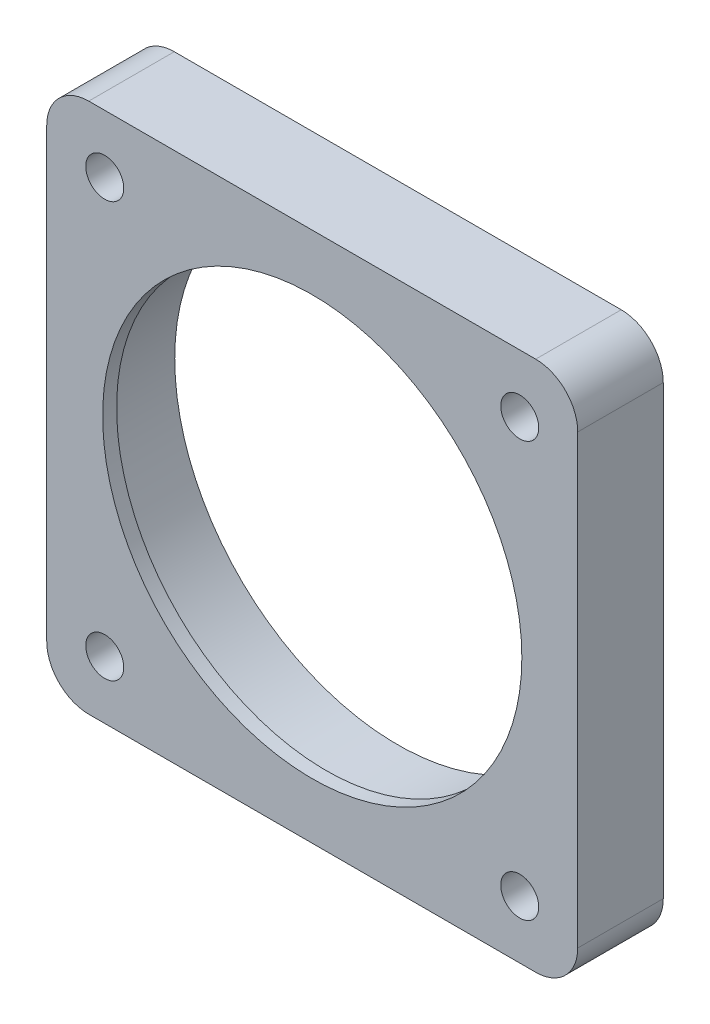
ISO-10303-21;
HEADER;
FILE_DESCRIPTION(('STEP AP214'),'2;1');
FILE_NAME('part.step','',(''),(''),'','','');
FILE_SCHEMA(('AUTOMOTIVE_DESIGN { 1 0 10303 214 1 1 1 1 }'));
ENDSEC;
DATA;
#1=APPLICATION_CONTEXT('core data for automotive mechanical design processes');
#2=APPLICATION_PROTOCOL_DEFINITION('international standard','automotive_design',2000,#1);
#3=PRODUCT_CONTEXT('',#1,'mechanical');
#4=PRODUCT('Part','Part','',(#3));
#5=PRODUCT_RELATED_PRODUCT_CATEGORY('part','',(#4));
#6=PRODUCT_DEFINITION_FORMATION('','',#4);
#7=PRODUCT_DEFINITION_CONTEXT('part definition',#1,'design');
#8=PRODUCT_DEFINITION('design','',#6,#7);
#9=PRODUCT_DEFINITION_SHAPE('','',#8);
#10=(LENGTH_UNIT() NAMED_UNIT(*) SI_UNIT(.MILLI.,.METRE.));
#11=(NAMED_UNIT(*) PLANE_ANGLE_UNIT() SI_UNIT($,.RADIAN.));
#12=(NAMED_UNIT(*) SI_UNIT($,.STERADIAN.) SOLID_ANGLE_UNIT());
#13=UNCERTAINTY_MEASURE_WITH_UNIT(LENGTH_MEASURE(1.E-05),#10,'distance_accuracy_value','');
#14=(GEOMETRIC_REPRESENTATION_CONTEXT(3) GLOBAL_UNCERTAINTY_ASSIGNED_CONTEXT((#13)) GLOBAL_UNIT_ASSIGNED_CONTEXT((#10,
#11,#12)) REPRESENTATION_CONTEXT('',''));
#15=CARTESIAN_POINT('',(0.,0.,0.));
#16=DIRECTION('',(0.,0.,1.));
#17=DIRECTION('',(1.,0.,0.));
#18=AXIS2_PLACEMENT_3D('',#15,#16,#17);
#19=CARTESIAN_POINT('',(0.,0.,81.3779438461319));
#20=DIRECTION('',(0.,0.,-1.));
#21=DIRECTION('',(-1.,0.,0.));
#22=AXIS2_PLACEMENT_3D('',#19,#20,#21);
#23=CYLINDRICAL_SURFACE('',#22,25.3365);
#24=CARTESIAN_POINT('',(0.,0.,0.));
#25=DIRECTION('',(0.,0.,-1.));
#26=DIRECTION('',(-1.,0.,0.));
#27=AXIS2_PLACEMENT_3D('',#24,#25,#26);
#28=CIRCLE('',#27,25.3365);
#29=CARTESIAN_POINT('',(-25.3365,0.,0.));
#30=VERTEX_POINT('',#29);
#31=EDGE_CURVE('E168',#30,#30,#28,.F.);
#32=ORIENTED_EDGE('',*,*,#31,.F.);
#33=EDGE_LOOP('',(#32));
#34=FACE_BOUND('',#33,.T.);
#35=CARTESIAN_POINT('',(0.,0.,8.128));
#36=DIRECTION('',(0.,0.,1.));
#37=DIRECTION('',(1.,0.,0.));
#38=AXIS2_PLACEMENT_3D('',#35,#36,#37);
#39=CIRCLE('',#38,25.3365);
#40=CARTESIAN_POINT('',(25.3365,0.,8.128));
#41=VERTEX_POINT('',#40);
#42=EDGE_CURVE('E14',#41,#41,#39,.F.);
#43=ORIENTED_EDGE('',*,*,#42,.F.);
#44=EDGE_LOOP('',(#43));
#45=FACE_BOUND('',#44,.T.);
#46=ADVANCED_FACE('F56',(#34,#45),#23,.F.);
#47=CARTESIAN_POINT('',(0.,-30.1625000000023,9.7155));
#48=DIRECTION('',(0.,-1.,0.));
#49=DIRECTION('',(0.,0.,-1.));
#50=AXIS2_PLACEMENT_3D('',#47,#48,#49);
#51=PLANE('',#50);
#52=DIRECTION('',(-1.,0.,0.));
#53=VECTOR('',#52,1.);
#54=CARTESIAN_POINT('',(0.,-30.1625000000023,0.));
#55=LINE('',#54,#53);
#56=CARTESIAN_POINT('',(25.3873000000011,-30.1625,0.));
#57=VERTEX_POINT('',#56);
#58=CARTESIAN_POINT('',(-25.3873000000011,-30.1625,0.));
#59=VERTEX_POINT('',#58);
#60=EDGE_CURVE('E165',#57,#59,#55,.T.);
#61=ORIENTED_EDGE('',*,*,#60,.F.);
#62=DIRECTION('',(0.,0.,-1.));
#63=VECTOR('',#62,1.);
#64=CARTESIAN_POINT('',(25.3873000000011,-30.1625,9.7155));
#65=LINE('',#64,#63);
#66=CARTESIAN_POINT('',(25.3873000000011,-30.1625,9.7155));
#67=VERTEX_POINT('',#66);
#68=EDGE_CURVE('E65',#67,#57,#65,.T.);
#69=ORIENTED_EDGE('',*,*,#68,.F.);
#70=DIRECTION('',(-1.,0.,0.));
#71=VECTOR('',#70,1.);
#72=CARTESIAN_POINT('',(0.,-30.1625000000023,9.7155));
#73=LINE('',#72,#71);
#74=CARTESIAN_POINT('',(-25.3873000000011,-30.1625,9.7155));
#75=VERTEX_POINT('',#74);
#76=EDGE_CURVE('E197',#67,#75,#73,.T.);
#77=ORIENTED_EDGE('',*,*,#76,.T.);
#78=DIRECTION('',(0.,0.,-1.));
#79=VECTOR('',#78,1.);
#80=CARTESIAN_POINT('',(-25.3873000000011,-30.1625,9.7155));
#81=LINE('',#80,#79);
#82=EDGE_CURVE('E73',#75,#59,#81,.T.);
#83=ORIENTED_EDGE('',*,*,#82,.T.);
#84=EDGE_LOOP('',(#61,#69,#77,#83));
#85=FACE_BOUND('',#84,.T.);
#86=ADVANCED_FACE('F58',(#85),#51,.T.);
#87=CARTESIAN_POINT('',(25.3873000000011,-25.3873,9.7155));
#88=DIRECTION('',(0.,0.,-1.));
#89=DIRECTION('',(-1.,0.,0.));
#90=AXIS2_PLACEMENT_3D('',#87,#88,#89);
#91=CYLINDRICAL_SURFACE('',#90,4.7752);
#92=CARTESIAN_POINT('',(25.3873000000011,-25.3873,0.));
#93=DIRECTION('',(0.,0.,1.));
#94=DIRECTION('',(1.,0.,0.));
#95=AXIS2_PLACEMENT_3D('',#92,#93,#94);
#96=CIRCLE('',#95,4.7752);
#97=CARTESIAN_POINT('',(30.1625000000011,-25.3873,0.));
#98=VERTEX_POINT('',#97);
#99=EDGE_CURVE('E167',#98,#57,#96,.F.);
#100=ORIENTED_EDGE('',*,*,#99,.F.);
#101=DIRECTION('',(0.,0.,-1.));
#102=VECTOR('',#101,1.);
#103=CARTESIAN_POINT('',(30.1625000000011,-25.3873,9.7155));
#104=LINE('',#103,#102);
#105=CARTESIAN_POINT('',(30.1625000000011,-25.3873,9.7155));
#106=VERTEX_POINT('',#105);
#107=EDGE_CURVE('E205',#106,#98,#104,.T.);
#108=ORIENTED_EDGE('',*,*,#107,.F.);
#109=CARTESIAN_POINT('',(25.3873000000011,-25.3873,9.7155));
#110=DIRECTION('',(0.,0.,1.));
#111=DIRECTION('',(1.,0.,0.));
#112=AXIS2_PLACEMENT_3D('',#109,#110,#111);
#113=CIRCLE('',#112,4.7752);
#114=EDGE_CURVE('E220',#106,#67,#113,.F.);
#115=ORIENTED_EDGE('',*,*,#114,.T.);
#116=ORIENTED_EDGE('',*,*,#68,.T.);
#117=EDGE_LOOP('',(#100,#108,#115,#116));
#118=FACE_BOUND('',#117,.T.);
#119=ADVANCED_FACE('F257',(#118),#91,.T.);
#120=CARTESIAN_POINT('',(30.1625000000011,0.,9.7155));
#121=DIRECTION('',(-1.,0.,0.));
#122=DIRECTION('',(0.,0.,1.));
#123=AXIS2_PLACEMENT_3D('',#120,#121,#122);
#124=PLANE('',#123);
#125=DIRECTION('',(0.,1.,0.));
#126=VECTOR('',#125,1.);
#127=CARTESIAN_POINT('',(30.1625000000011,0.,0.));
#128=LINE('',#127,#126);
#129=CARTESIAN_POINT('',(30.1625000000011,25.3873,0.));
#130=VERTEX_POINT('',#129);
#131=EDGE_CURVE('E171',#98,#130,#128,.T.);
#132=ORIENTED_EDGE('',*,*,#131,.T.);
#133=DIRECTION('',(0.,0.,-1.));
#134=VECTOR('',#133,1.);
#135=CARTESIAN_POINT('',(30.1625000000011,25.3873,9.7155));
#136=LINE('',#135,#134);
#137=CARTESIAN_POINT('',(30.1625000000011,25.3873,9.7155));
#138=VERTEX_POINT('',#137);
#139=EDGE_CURVE('E203',#138,#130,#136,.T.);
#140=ORIENTED_EDGE('',*,*,#139,.F.);
#141=DIRECTION('',(0.,1.,0.));
#142=VECTOR('',#141,1.);
#143=CARTESIAN_POINT('',(30.1625000000011,0.,9.7155));
#144=LINE('',#143,#142);
#145=EDGE_CURVE('E223',#106,#138,#144,.T.);
#146=ORIENTED_EDGE('',*,*,#145,.F.);
#147=ORIENTED_EDGE('',*,*,#107,.T.);
#148=EDGE_LOOP('',(#132,#140,#146,#147));
#149=FACE_BOUND('',#148,.T.);
#150=ADVANCED_FACE('F234',(#149),#124,.F.);
#151=CARTESIAN_POINT('',(25.3873000000011,25.3873,9.7155));
#152=DIRECTION('',(0.,0.,-1.));
#153=DIRECTION('',(-1.,0.,0.));
#154=AXIS2_PLACEMENT_3D('',#151,#152,#153);
#155=CYLINDRICAL_SURFACE('',#154,4.7752);
#156=CARTESIAN_POINT('',(25.3873000000011,25.3873,0.));
#157=DIRECTION('',(0.,0.,1.));
#158=DIRECTION('',(1.,0.,0.));
#159=AXIS2_PLACEMENT_3D('',#156,#157,#158);
#160=CIRCLE('',#159,4.7752);
#161=CARTESIAN_POINT('',(25.3873000000011,30.1625,0.));
#162=VERTEX_POINT('',#161);
#163=EDGE_CURVE('E174',#162,#130,#160,.F.);
#164=ORIENTED_EDGE('',*,*,#163,.F.);
#165=DIRECTION('',(0.,0.,-1.));
#166=VECTOR('',#165,1.);
#167=CARTESIAN_POINT('',(25.3873000000011,30.1625,9.7155));
#168=LINE('',#167,#166);
#169=CARTESIAN_POINT('',(25.3873000000011,30.1625,9.7155));
#170=VERTEX_POINT('',#169);
#171=EDGE_CURVE('E201',#170,#162,#168,.T.);
#172=ORIENTED_EDGE('',*,*,#171,.F.);
#173=CARTESIAN_POINT('',(25.3873000000011,25.3873,9.7155));
#174=DIRECTION('',(0.,0.,1.));
#175=DIRECTION('',(1.,0.,0.));
#176=AXIS2_PLACEMENT_3D('',#173,#174,#175);
#177=CIRCLE('',#176,4.7752);
#178=EDGE_CURVE('E225',#170,#138,#177,.F.);
#179=ORIENTED_EDGE('',*,*,#178,.T.);
#180=ORIENTED_EDGE('',*,*,#139,.T.);
#181=EDGE_LOOP('',(#164,#172,#179,#180));
#182=FACE_BOUND('',#181,.T.);
#183=ADVANCED_FACE('F229',(#182),#155,.T.);
#184=CARTESIAN_POINT('',(0.,30.1625,9.7155));
#185=DIRECTION('',(0.,-1.,0.));
#186=DIRECTION('',(1.,0.,0.));
#187=AXIS2_PLACEMENT_3D('',#184,#185,#186);
#188=PLANE('',#187);
#189=DIRECTION('',(-1.,0.,0.));
#190=VECTOR('',#189,1.);
#191=CARTESIAN_POINT('',(0.,30.1625,0.));
#192=LINE('',#191,#190);
#193=CARTESIAN_POINT('',(-25.3873000000011,30.1625,0.));
#194=VERTEX_POINT('',#193);
#195=EDGE_CURVE('E177',#162,#194,#192,.T.);
#196=ORIENTED_EDGE('',*,*,#195,.T.);
#197=DIRECTION('',(0.,0.,-1.));
#198=VECTOR('',#197,1.);
#199=CARTESIAN_POINT('',(-25.3873000000011,30.1625,9.7155));
#200=LINE('',#199,#198);
#201=CARTESIAN_POINT('',(-25.3873000000011,30.1625,9.7155));
#202=VERTEX_POINT('',#201);
#203=EDGE_CURVE('E145',#202,#194,#200,.T.);
#204=ORIENTED_EDGE('',*,*,#203,.F.);
#205=DIRECTION('',(-1.,0.,0.));
#206=VECTOR('',#205,1.);
#207=CARTESIAN_POINT('',(0.,30.1625,9.7155));
#208=LINE('',#207,#206);
#209=EDGE_CURVE('E133',#170,#202,#208,.T.);
#210=ORIENTED_EDGE('',*,*,#209,.F.);
#211=ORIENTED_EDGE('',*,*,#171,.T.);
#212=EDGE_LOOP('',(#196,#204,#210,#211));
#213=FACE_BOUND('',#212,.T.);
#214=ADVANCED_FACE('F242',(#213),#188,.F.);
#215=CARTESIAN_POINT('',(-25.3873000000011,25.3873,9.7155));
#216=DIRECTION('',(0.,0.,-1.));
#217=DIRECTION('',(-1.,0.,0.));
#218=AXIS2_PLACEMENT_3D('',#215,#216,#217);
#219=CYLINDRICAL_SURFACE('',#218,4.7752);
#220=CARTESIAN_POINT('',(-25.3873000000011,25.3873,0.));
#221=DIRECTION('',(0.,0.,1.));
#222=DIRECTION('',(1.,0.,0.));
#223=AXIS2_PLACEMENT_3D('',#220,#221,#222);
#224=CIRCLE('',#223,4.7752);
#225=CARTESIAN_POINT('',(-30.1625000000011,25.3873,0.));
#226=VERTEX_POINT('',#225);
#227=EDGE_CURVE('E142',#194,#226,#224,.T.);
#228=ORIENTED_EDGE('',*,*,#227,.T.);
#229=DIRECTION('',(0.,0.,-1.));
#230=VECTOR('',#229,1.);
#231=CARTESIAN_POINT('',(-30.1625000000011,25.3873,9.7155));
#232=LINE('',#231,#230);
#233=CARTESIAN_POINT('',(-30.1625000000011,25.3873,9.7155));
#234=VERTEX_POINT('',#233);
#235=EDGE_CURVE('E139',#234,#226,#232,.T.);
#236=ORIENTED_EDGE('',*,*,#235,.F.);
#237=CARTESIAN_POINT('',(-25.3873000000011,25.3873,9.7155));
#238=DIRECTION('',(0.,0.,1.));
#239=DIRECTION('',(1.,0.,0.));
#240=AXIS2_PLACEMENT_3D('',#237,#238,#239);
#241=CIRCLE('',#240,4.7752);
#242=EDGE_CURVE('E124',#202,#234,#241,.T.);
#243=ORIENTED_EDGE('',*,*,#242,.F.);
#244=ORIENTED_EDGE('',*,*,#203,.T.);
#245=EDGE_LOOP('',(#228,#236,#243,#244));
#246=FACE_BOUND('',#245,.T.);
#247=ADVANCED_FACE('F140',(#246),#219,.T.);
#248=CARTESIAN_POINT('',(-30.1625000000011,0.,9.7155));
#249=DIRECTION('',(-1.,0.,0.));
#250=DIRECTION('',(0.,0.,1.));
#251=AXIS2_PLACEMENT_3D('',#248,#249,#250);
#252=PLANE('',#251);
#253=DIRECTION('',(0.,1.,0.));
#254=VECTOR('',#253,1.);
#255=CARTESIAN_POINT('',(-30.1625000000011,0.,0.));
#256=LINE('',#255,#254);
#257=CARTESIAN_POINT('',(-30.1625000000011,-25.3873,0.));
#258=VERTEX_POINT('',#257);
#259=EDGE_CURVE('E180',#258,#226,#256,.T.);
#260=ORIENTED_EDGE('',*,*,#259,.F.);
#261=DIRECTION('',(0.,0.,-1.));
#262=VECTOR('',#261,1.);
#263=CARTESIAN_POINT('',(-30.1625000000011,-25.3873,9.7155));
#264=LINE('',#263,#262);
#265=CARTESIAN_POINT('',(-30.1625000000011,-25.3873,9.7155));
#266=VERTEX_POINT('',#265);
#267=EDGE_CURVE('E99',#266,#258,#264,.T.);
#268=ORIENTED_EDGE('',*,*,#267,.F.);
#269=DIRECTION('',(0.,1.,0.));
#270=VECTOR('',#269,1.);
#271=CARTESIAN_POINT('',(-30.1625000000011,0.,9.7155));
#272=LINE('',#271,#270);
#273=EDGE_CURVE('E130',#266,#234,#272,.T.);
#274=ORIENTED_EDGE('',*,*,#273,.T.);
#275=ORIENTED_EDGE('',*,*,#235,.T.);
#276=EDGE_LOOP('',(#260,#268,#274,#275));
#277=FACE_BOUND('',#276,.T.);
#278=ADVANCED_FACE('F147',(#277),#252,.T.);
#279=CARTESIAN_POINT('',(-23.5731723178075,23.5731723178056,9.7155));
#280=DIRECTION('',(0.,0.,-1.));
#281=DIRECTION('',(-1.,0.,0.));
#282=AXIS2_PLACEMENT_3D('',#279,#280,#281);
#283=CYLINDRICAL_SURFACE('',#282,2.15900000000118);
#284=CARTESIAN_POINT('',(-23.5731723178075,23.5731723178056,9.7155));
#285=DIRECTION('',(0.,0.,1.));
#286=DIRECTION('',(1.,0.,0.));
#287=AXIS2_PLACEMENT_3D('',#284,#285,#286);
#288=CIRCLE('',#287,2.15900000000118);
#289=CARTESIAN_POINT('',(-21.4141723178063,23.5731723178056,9.7155));
#290=VERTEX_POINT('',#289);
#291=EDGE_CURVE('E162',#290,#290,#288,.T.);
#292=ORIENTED_EDGE('',*,*,#291,.T.);
#293=EDGE_LOOP('',(#292));
#294=FACE_BOUND('',#293,.T.);
#295=CARTESIAN_POINT('',(-23.5731723178075,23.5731723178056,0.));
#296=DIRECTION('',(0.,0.,1.));
#297=DIRECTION('',(1.,0.,0.));
#298=AXIS2_PLACEMENT_3D('',#295,#296,#297);
#299=CIRCLE('',#298,2.15900000000118);
#300=CARTESIAN_POINT('',(-21.4141723178063,23.5731723178056,0.));
#301=VERTEX_POINT('',#300);
#302=EDGE_CURVE('E194',#301,#301,#299,.T.);
#303=ORIENTED_EDGE('',*,*,#302,.F.);
#304=EDGE_LOOP('',(#303));
#305=FACE_BOUND('',#304,.T.);
#306=ADVANCED_FACE('F268',(#294,#305),#283,.F.);
#307=CARTESIAN_POINT('',(23.573172317807,23.573172317806,9.7155));
#308=DIRECTION('',(0.,0.,-1.));
#309=DIRECTION('',(-1.,0.,0.));
#310=AXIS2_PLACEMENT_3D('',#307,#308,#309);
#311=CYLINDRICAL_SURFACE('',#310,2.15899999999951);
#312=CARTESIAN_POINT('',(23.573172317807,23.573172317806,9.7155));
#313=DIRECTION('',(0.,0.,1.));
#314=DIRECTION('',(1.,0.,0.));
#315=AXIS2_PLACEMENT_3D('',#312,#313,#314);
#316=CIRCLE('',#315,2.15899999999951);
#317=CARTESIAN_POINT('',(25.7321723178065,23.573172317806,9.7155));
#318=VERTEX_POINT('',#317);
#319=EDGE_CURVE('E159',#318,#318,#316,.T.);
#320=ORIENTED_EDGE('',*,*,#319,.T.);
#321=EDGE_LOOP('',(#320));
#322=FACE_BOUND('',#321,.T.);
#323=CARTESIAN_POINT('',(23.573172317807,23.573172317806,0.));
#324=DIRECTION('',(0.,0.,1.));
#325=DIRECTION('',(1.,0.,0.));
#326=AXIS2_PLACEMENT_3D('',#323,#324,#325);
#327=CIRCLE('',#326,2.15899999999951);
#328=CARTESIAN_POINT('',(25.7321723178065,23.573172317806,0.));
#329=VERTEX_POINT('',#328);
#330=EDGE_CURVE('E191',#329,#329,#327,.T.);
#331=ORIENTED_EDGE('',*,*,#330,.F.);
#332=EDGE_LOOP('',(#331));
#333=FACE_BOUND('',#332,.T.);
#334=ADVANCED_FACE('F271',(#322,#333),#311,.F.);
#335=CARTESIAN_POINT('',(23.5731723178046,-23.5731723178084,9.7155));
#336=DIRECTION('',(0.,0.,-1.));
#337=DIRECTION('',(-1.,0.,0.));
#338=AXIS2_PLACEMENT_3D('',#335,#336,#337);
#339=CYLINDRICAL_SURFACE('',#338,2.15899999999784);
#340=CARTESIAN_POINT('',(23.5731723178046,-23.5731723178084,9.7155));
#341=DIRECTION('',(0.,0.,1.));
#342=DIRECTION('',(1.,0.,0.));
#343=AXIS2_PLACEMENT_3D('',#340,#341,#342);
#344=CIRCLE('',#343,2.15899999999784);
#345=CARTESIAN_POINT('',(25.7321723178025,-23.5731723178084,9.7155));
#346=VERTEX_POINT('',#345);
#347=EDGE_CURVE('E156',#346,#346,#344,.T.);
#348=ORIENTED_EDGE('',*,*,#347,.T.);
#349=EDGE_LOOP('',(#348));
#350=FACE_BOUND('',#349,.T.);
#351=CARTESIAN_POINT('',(23.5731723178046,-23.5731723178084,0.));
#352=DIRECTION('',(0.,0.,1.));
#353=DIRECTION('',(1.,0.,0.));
#354=AXIS2_PLACEMENT_3D('',#351,#352,#353);
#355=CIRCLE('',#354,2.15899999999784);
#356=CARTESIAN_POINT('',(25.7321723178025,-23.5731723178084,0.));
#357=VERTEX_POINT('',#356);
#358=EDGE_CURVE('E188',#357,#357,#355,.T.);
#359=ORIENTED_EDGE('',*,*,#358,.F.);
#360=EDGE_LOOP('',(#359));
#361=FACE_BOUND('',#360,.T.);
#362=ADVANCED_FACE('F275',(#350,#361),#339,.F.);
#363=CARTESIAN_POINT('',(-23.5731723178098,-23.5731723178032,9.7155));
#364=DIRECTION('',(0.,0.,-1.));
#365=DIRECTION('',(-1.,0.,0.));
#366=AXIS2_PLACEMENT_3D('',#363,#364,#365);
#367=CYLINDRICAL_SURFACE('',#366,2.15899999999618);
#368=CARTESIAN_POINT('',(-23.5731723178098,-23.5731723178032,9.7155));
#369=DIRECTION('',(0.,0.,1.));
#370=DIRECTION('',(1.,0.,0.));
#371=AXIS2_PLACEMENT_3D('',#368,#369,#370);
#372=CIRCLE('',#371,2.15899999999618);
#373=CARTESIAN_POINT('',(-21.4141723178137,-23.5731723178032,9.7155));
#374=VERTEX_POINT('',#373);
#375=EDGE_CURVE('E150',#374,#374,#372,.T.);
#376=ORIENTED_EDGE('',*,*,#375,.T.);
#377=EDGE_LOOP('',(#376));
#378=FACE_BOUND('',#377,.T.);
#379=CARTESIAN_POINT('',(-23.5731723178098,-23.5731723178032,0.));
#380=DIRECTION('',(0.,0.,1.));
#381=DIRECTION('',(1.,0.,0.));
#382=AXIS2_PLACEMENT_3D('',#379,#380,#381);
#383=CIRCLE('',#382,2.15899999999618);
#384=CARTESIAN_POINT('',(-21.4141723178137,-23.5731723178032,0.));
#385=VERTEX_POINT('',#384);
#386=EDGE_CURVE('E185',#385,#385,#383,.T.);
#387=ORIENTED_EDGE('',*,*,#386,.F.);
#388=EDGE_LOOP('',(#387));
#389=FACE_BOUND('',#388,.T.);
#390=ADVANCED_FACE('F279',(#378,#389),#367,.F.);
#391=CARTESIAN_POINT('',(-25.3873000000011,-25.3873,9.7155));
#392=DIRECTION('',(0.,0.,-1.));
#393=DIRECTION('',(-1.,0.,0.));
#394=AXIS2_PLACEMENT_3D('',#391,#392,#393);
#395=CYLINDRICAL_SURFACE('',#394,4.7752);
#396=CARTESIAN_POINT('',(-25.3873000000011,-25.3873,0.));
#397=DIRECTION('',(0.,0.,1.));
#398=DIRECTION('',(1.,0.,0.));
#399=AXIS2_PLACEMENT_3D('',#396,#397,#398);
#400=CIRCLE('',#399,4.7752);
#401=EDGE_CURVE('E182',#59,#258,#400,.F.);
#402=ORIENTED_EDGE('',*,*,#401,.F.);
#403=ORIENTED_EDGE('',*,*,#82,.F.);
#404=CARTESIAN_POINT('',(-25.3873000000011,-25.3873,9.7155));
#405=DIRECTION('',(0.,0.,1.));
#406=DIRECTION('',(1.,0.,0.));
#407=AXIS2_PLACEMENT_3D('',#404,#405,#406);
#408=CIRCLE('',#407,4.7752);
#409=EDGE_CURVE('E148',#75,#266,#408,.F.);
#410=ORIENTED_EDGE('',*,*,#409,.T.);
#411=ORIENTED_EDGE('',*,*,#267,.T.);
#412=EDGE_LOOP('',(#402,#403,#410,#411));
#413=FACE_BOUND('',#412,.T.);
#414=ADVANCED_FACE('F265',(#413),#395,.T.);
#415=CARTESIAN_POINT('',(0.,0.,9.7155));
#416=DIRECTION('',(0.,0.,1.));
#417=DIRECTION('',(1.,0.,0.));
#418=AXIS2_PLACEMENT_3D('',#415,#416,#417);
#419=PLANE('',#418);
#420=ORIENTED_EDGE('',*,*,#76,.F.);
#421=ORIENTED_EDGE('',*,*,#114,.F.);
#422=ORIENTED_EDGE('',*,*,#145,.T.);
#423=ORIENTED_EDGE('',*,*,#178,.F.);
#424=ORIENTED_EDGE('',*,*,#209,.T.);
#425=ORIENTED_EDGE('',*,*,#242,.T.);
#426=ORIENTED_EDGE('',*,*,#273,.F.);
#427=ORIENTED_EDGE('',*,*,#409,.F.);
#428=EDGE_LOOP('',(#420,#421,#422,#423,#424,#425,#426,#427));
#429=FACE_BOUND('',#428,.T.);
#430=ORIENTED_EDGE('',*,*,#375,.F.);
#431=EDGE_LOOP('',(#430));
#432=FACE_BOUND('',#431,.T.);
#433=ORIENTED_EDGE('',*,*,#347,.F.);
#434=EDGE_LOOP('',(#433));
#435=FACE_BOUND('',#434,.T.);
#436=ORIENTED_EDGE('',*,*,#319,.F.);
#437=EDGE_LOOP('',(#436));
#438=FACE_BOUND('',#437,.T.);
#439=ORIENTED_EDGE('',*,*,#291,.F.);
#440=EDGE_LOOP('',(#439));
#441=FACE_BOUND('',#440,.T.);
#442=CARTESIAN_POINT('',(0.,0.,9.7155));
#443=DIRECTION('',(0.,0.,1.));
#444=DIRECTION('',(1.,0.,0.));
#445=AXIS2_PLACEMENT_3D('',#442,#443,#444);
#446=CIRCLE('',#445,23.8125);
#447=CARTESIAN_POINT('',(23.8125,0.,9.7155));
#448=VERTEX_POINT('',#447);
#449=EDGE_CURVE('E212',#448,#448,#446,.T.);
#450=ORIENTED_EDGE('',*,*,#449,.F.);
#451=EDGE_LOOP('',(#450));
#452=FACE_BOUND('',#451,.T.);
#453=ADVANCED_FACE('F126',(#429,#432,#435,#438,#441,#452),#419,.T.);
#454=CARTESIAN_POINT('',(0.,0.,0.));
#455=DIRECTION('',(0.,0.,1.));
#456=DIRECTION('',(1.,0.,0.));
#457=AXIS2_PLACEMENT_3D('',#454,#455,#456);
#458=PLANE('',#457);
#459=ORIENTED_EDGE('',*,*,#60,.T.);
#460=ORIENTED_EDGE('',*,*,#401,.T.);
#461=ORIENTED_EDGE('',*,*,#259,.T.);
#462=ORIENTED_EDGE('',*,*,#227,.F.);
#463=ORIENTED_EDGE('',*,*,#195,.F.);
#464=ORIENTED_EDGE('',*,*,#163,.T.);
#465=ORIENTED_EDGE('',*,*,#131,.F.);
#466=ORIENTED_EDGE('',*,*,#99,.T.);
#467=EDGE_LOOP('',(#459,#460,#461,#462,#463,#464,#465,#466));
#468=FACE_BOUND('',#467,.T.);
#469=ORIENTED_EDGE('',*,*,#386,.T.);
#470=EDGE_LOOP('',(#469));
#471=FACE_BOUND('',#470,.T.);
#472=ORIENTED_EDGE('',*,*,#358,.T.);
#473=EDGE_LOOP('',(#472));
#474=FACE_BOUND('',#473,.T.);
#475=ORIENTED_EDGE('',*,*,#330,.T.);
#476=EDGE_LOOP('',(#475));
#477=FACE_BOUND('',#476,.T.);
#478=ORIENTED_EDGE('',*,*,#302,.T.);
#479=EDGE_LOOP('',(#478));
#480=FACE_BOUND('',#479,.T.);
#481=ORIENTED_EDGE('',*,*,#31,.T.);
#482=EDGE_LOOP('',(#481));
#483=FACE_BOUND('',#482,.T.);
#484=ADVANCED_FACE('F239',(#468,#471,#474,#477,#480,#483),#458,.F.);
#485=CARTESIAN_POINT('',(0.,0.,8.128));
#486=DIRECTION('',(0.,0.,1.));
#487=DIRECTION('',(1.,0.,0.));
#488=AXIS2_PLACEMENT_3D('',#485,#486,#487);
#489=PLANE('',#488);
#490=CARTESIAN_POINT('',(0.,0.,8.128));
#491=DIRECTION('',(0.,0.,1.));
#492=DIRECTION('',(1.,0.,0.));
#493=AXIS2_PLACEMENT_3D('',#490,#491,#492);
#494=CIRCLE('',#493,23.8125);
#495=CARTESIAN_POINT('',(23.8125,0.,8.128));
#496=VERTEX_POINT('',#495);
#497=EDGE_CURVE('E208',#496,#496,#494,.T.);
#498=ORIENTED_EDGE('',*,*,#497,.T.);
#499=EDGE_LOOP('',(#498));
#500=FACE_BOUND('',#499,.T.);
#501=ORIENTED_EDGE('',*,*,#42,.T.);
#502=EDGE_LOOP('',(#501));
#503=FACE_BOUND('',#502,.T.);
#504=ADVANCED_FACE('F261',(#500,#503),#489,.F.);
#505=CARTESIAN_POINT('',(0.,0.,8.128));
#506=DIRECTION('',(0.,0.,1.));
#507=DIRECTION('',(1.,0.,0.));
#508=AXIS2_PLACEMENT_3D('',#505,#506,#507);
#509=CYLINDRICAL_SURFACE('',#508,23.8125);
#510=ORIENTED_EDGE('',*,*,#497,.F.);
#511=EDGE_LOOP('',(#510));
#512=FACE_BOUND('',#511,.T.);
#513=ORIENTED_EDGE('',*,*,#449,.T.);
#514=EDGE_LOOP('',(#513));
#515=FACE_BOUND('',#514,.T.);
#516=ADVANCED_FACE('F325',(#512,#515),#509,.F.);
#517=CLOSED_SHELL('',(#46,#86,#119,#150,#183,#214,#247,#278,#306,#334,#362,#390,#414,#453,#484,
#504,#516));
#518=MANIFOLD_SOLID_BREP('B2',#517);
#519=ADVANCED_BREP_SHAPE_REPRESENTATION('',(#18,#518),#14);
#520=SHAPE_DEFINITION_REPRESENTATION(#9,#519);
ENDSEC;
END-ISO-10303-21;
